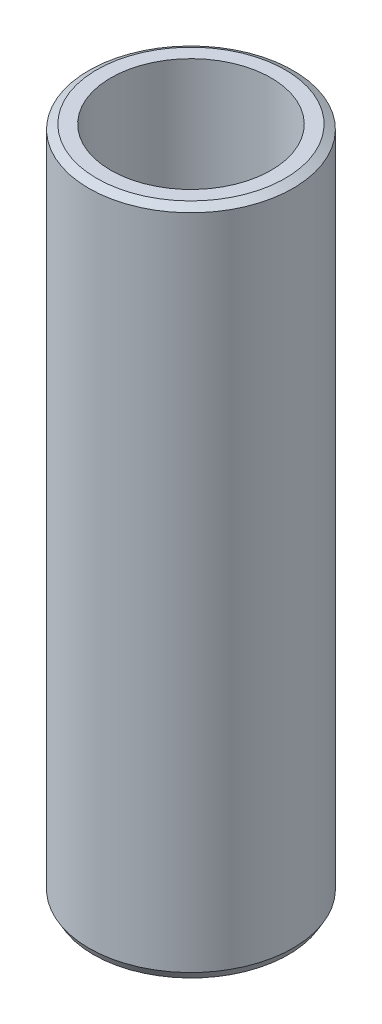
ISO-10303-21;
HEADER;
FILE_DESCRIPTION(('STEP AP214'),'2;1');
FILE_NAME('part.step','',(''),(''),'','','');
FILE_SCHEMA(('AUTOMOTIVE_DESIGN { 1 0 10303 214 1 1 1 1 }'));
ENDSEC;
DATA;
#1=APPLICATION_CONTEXT('core data for automotive mechanical design processes');
#2=APPLICATION_PROTOCOL_DEFINITION('international standard','automotive_design',2000,#1);
#3=PRODUCT_CONTEXT('',#1,'mechanical');
#4=PRODUCT('Part','Part','',(#3));
#5=PRODUCT_RELATED_PRODUCT_CATEGORY('part','',(#4));
#6=PRODUCT_DEFINITION_FORMATION('','',#4);
#7=PRODUCT_DEFINITION_CONTEXT('part definition',#1,'design');
#8=PRODUCT_DEFINITION('design','',#6,#7);
#9=PRODUCT_DEFINITION_SHAPE('','',#8);
#10=(LENGTH_UNIT() NAMED_UNIT(*) SI_UNIT(.MILLI.,.METRE.));
#11=(NAMED_UNIT(*) PLANE_ANGLE_UNIT() SI_UNIT($,.RADIAN.));
#12=(NAMED_UNIT(*) SI_UNIT($,.STERADIAN.) SOLID_ANGLE_UNIT());
#13=UNCERTAINTY_MEASURE_WITH_UNIT(LENGTH_MEASURE(1.E-05),#10,'distance_accuracy_value','');
#14=(GEOMETRIC_REPRESENTATION_CONTEXT(3) GLOBAL_UNCERTAINTY_ASSIGNED_CONTEXT((#13)) GLOBAL_UNIT_ASSIGNED_CONTEXT((#10,
#11,#12)) REPRESENTATION_CONTEXT('',''));
#15=CARTESIAN_POINT('',(0.,0.,0.));
#16=DIRECTION('',(0.,0.,1.));
#17=DIRECTION('',(1.,0.,0.));
#18=AXIS2_PLACEMENT_3D('',#15,#16,#17);
#19=CARTESIAN_POINT('',(0.,196.950000522869,0.));
#20=DIRECTION('',(0.,-1.,0.));
#21=DIRECTION('',(0.,0.,-1.));
#22=AXIS2_PLACEMENT_3D('',#19,#20,#21);
#23=CYLINDRICAL_SURFACE('',#22,30.);
#24=CARTESIAN_POINT('',(0.,195.595847362859,0.));
#25=DIRECTION('',(0.,1.,0.));
#26=DIRECTION('',(0.,0.,1.));
#27=AXIS2_PLACEMENT_3D('',#24,#25,#26);
#28=CIRCLE('',#27,30.);
#29=CARTESIAN_POINT('',(0.,195.595847362859,30.));
#30=VERTEX_POINT('',#29);
#31=EDGE_CURVE('E50',#30,#30,#28,.F.);
#32=ORIENTED_EDGE('',*,*,#31,.T.);
#33=EDGE_LOOP('',(#32));
#34=FACE_BOUND('',#33,.T.);
#35=CARTESIAN_POINT('',(0.,2.34546207436745,0.));
#36=DIRECTION('',(0.,1.,0.));
#37=DIRECTION('',(0.,0.,1.));
#38=AXIS2_PLACEMENT_3D('',#35,#36,#37);
#39=CIRCLE('',#38,30.);
#40=CARTESIAN_POINT('',(0.,2.34546207436745,30.));
#41=VERTEX_POINT('',#40);
#42=EDGE_CURVE('E51',#41,#41,#39,.T.);
#43=ORIENTED_EDGE('',*,*,#42,.T.);
#44=EDGE_LOOP('',(#43));
#45=FACE_BOUND('',#44,.T.);
#46=ADVANCED_FACE('F39',(#34,#45),#23,.T.);
#47=CARTESIAN_POINT('',(0.,196.950000522869,0.));
#48=DIRECTION('',(0.,1.,0.));
#49=DIRECTION('',(0.,0.,1.));
#50=AXIS2_PLACEMENT_3D('',#47,#48,#49);
#51=PLANE('',#50);
#52=CARTESIAN_POINT('',(0.,196.950000522869,0.));
#53=DIRECTION('',(0.,1.,0.));
#54=DIRECTION('',(0.,0.,1.));
#55=AXIS2_PLACEMENT_3D('',#52,#53,#54);
#56=CIRCLE('',#55,27.6545379256325);
#57=CARTESIAN_POINT('',(0.,196.950000522869,27.6545379256325));
#58=VERTEX_POINT('',#57);
#59=EDGE_CURVE('E54',#58,#58,#56,.T.);
#60=ORIENTED_EDGE('',*,*,#59,.T.);
#61=EDGE_LOOP('',(#60));
#62=FACE_BOUND('',#61,.T.);
#63=CARTESIAN_POINT('',(0.,196.950000522869,0.));
#64=DIRECTION('',(0.,1.,0.));
#65=DIRECTION('',(0.,0.,1.));
#66=AXIS2_PLACEMENT_3D('',#63,#64,#65);
#67=CIRCLE('',#66,23.5367632130607);
#68=CARTESIAN_POINT('',(0.,196.950000522869,23.5367632130607));
#69=VERTEX_POINT('',#68);
#70=EDGE_CURVE('E58',#69,#69,#67,.T.);
#71=ORIENTED_EDGE('',*,*,#70,.F.);
#72=EDGE_LOOP('',(#71));
#73=FACE_BOUND('',#72,.T.);
#74=ADVANCED_FACE('F69',(#62,#73),#51,.T.);
#75=CARTESIAN_POINT('',(0.,0.,0.));
#76=DIRECTION('',(0.,1.,0.));
#77=DIRECTION('',(0.,0.,1.));
#78=AXIS2_PLACEMENT_3D('',#75,#76,#77);
#79=PLANE('',#78);
#80=CARTESIAN_POINT('',(0.,0.,0.));
#81=DIRECTION('',(0.,1.,0.));
#82=DIRECTION('',(0.,0.,1.));
#83=AXIS2_PLACEMENT_3D('',#80,#81,#82);
#84=CIRCLE('',#83,28.6458468399899);
#85=CARTESIAN_POINT('',(0.,0.,28.6458468399899));
#86=VERTEX_POINT('',#85);
#87=EDGE_CURVE('E10',#86,#86,#84,.F.);
#88=ORIENTED_EDGE('',*,*,#87,.T.);
#89=EDGE_LOOP('',(#88));
#90=FACE_BOUND('',#89,.T.);
#91=CARTESIAN_POINT('',(0.,0.,0.));
#92=DIRECTION('',(0.,1.,0.));
#93=DIRECTION('',(0.,0.,1.));
#94=AXIS2_PLACEMENT_3D('',#91,#92,#93);
#95=CIRCLE('',#94,23.5367632130607);
#96=CARTESIAN_POINT('',(0.,0.,23.5367632130607));
#97=VERTEX_POINT('',#96);
#98=EDGE_CURVE('E63',#97,#97,#95,.T.);
#99=ORIENTED_EDGE('',*,*,#98,.T.);
#100=EDGE_LOOP('',(#99));
#101=FACE_BOUND('',#100,.T.);
#102=ADVANCED_FACE('F75',(#90,#101),#79,.F.);
#103=CARTESIAN_POINT('',(0.,196.950000522869,0.));
#104=DIRECTION('',(0.,-1.,0.));
#105=DIRECTION('',(0.,0.,-1.));
#106=AXIS2_PLACEMENT_3D('',#103,#104,#105);
#107=CYLINDRICAL_SURFACE('',#106,23.5367632130607);
#108=ORIENTED_EDGE('',*,*,#70,.T.);
#109=EDGE_LOOP('',(#108));
#110=FACE_BOUND('',#109,.T.);
#111=ORIENTED_EDGE('',*,*,#98,.F.);
#112=EDGE_LOOP('',(#111));
#113=FACE_BOUND('',#112,.T.);
#114=ADVANCED_FACE('F70',(#110,#113),#107,.F.);
#115=CARTESIAN_POINT('',(0.,196.950000522869,0.));
#116=DIRECTION('',(0.,-1.,0.));
#117=DIRECTION('',(0.,0.,-1.));
#118=AXIS2_PLACEMENT_3D('',#115,#116,#117);
#119=CONICAL_SURFACE('',#118,27.6545379256325,1.0471975511966);
#120=ORIENTED_EDGE('',*,*,#31,.F.);
#121=EDGE_LOOP('',(#120));
#122=FACE_BOUND('',#121,.T.);
#123=ORIENTED_EDGE('',*,*,#59,.F.);
#124=EDGE_LOOP('',(#123));
#125=FACE_BOUND('',#124,.T.);
#126=ADVANCED_FACE('F81',(#122,#125),#119,.T.);
#127=CARTESIAN_POINT('',(0.,2.34546207436745,0.));
#128=DIRECTION('',(0.,1.,0.));
#129=DIRECTION('',(0.,0.,1.));
#130=AXIS2_PLACEMENT_3D('',#127,#128,#129);
#131=CONICAL_SURFACE('',#130,30.,0.523598775598301);
#132=ORIENTED_EDGE('',*,*,#87,.F.);
#133=EDGE_LOOP('',(#132));
#134=FACE_BOUND('',#133,.T.);
#135=ORIENTED_EDGE('',*,*,#42,.F.);
#136=EDGE_LOOP('',(#135));
#137=FACE_BOUND('',#136,.T.);
#138=ADVANCED_FACE('F45',(#134,#137),#131,.T.);
#139=CLOSED_SHELL('',(#46,#74,#102,#114,#126,#138));
#140=MANIFOLD_SOLID_BREP('B2',#139);
#141=ADVANCED_BREP_SHAPE_REPRESENTATION('',(#18,#140),#14);
#142=SHAPE_DEFINITION_REPRESENTATION(#9,#141);
ENDSEC;
END-ISO-10303-21;
